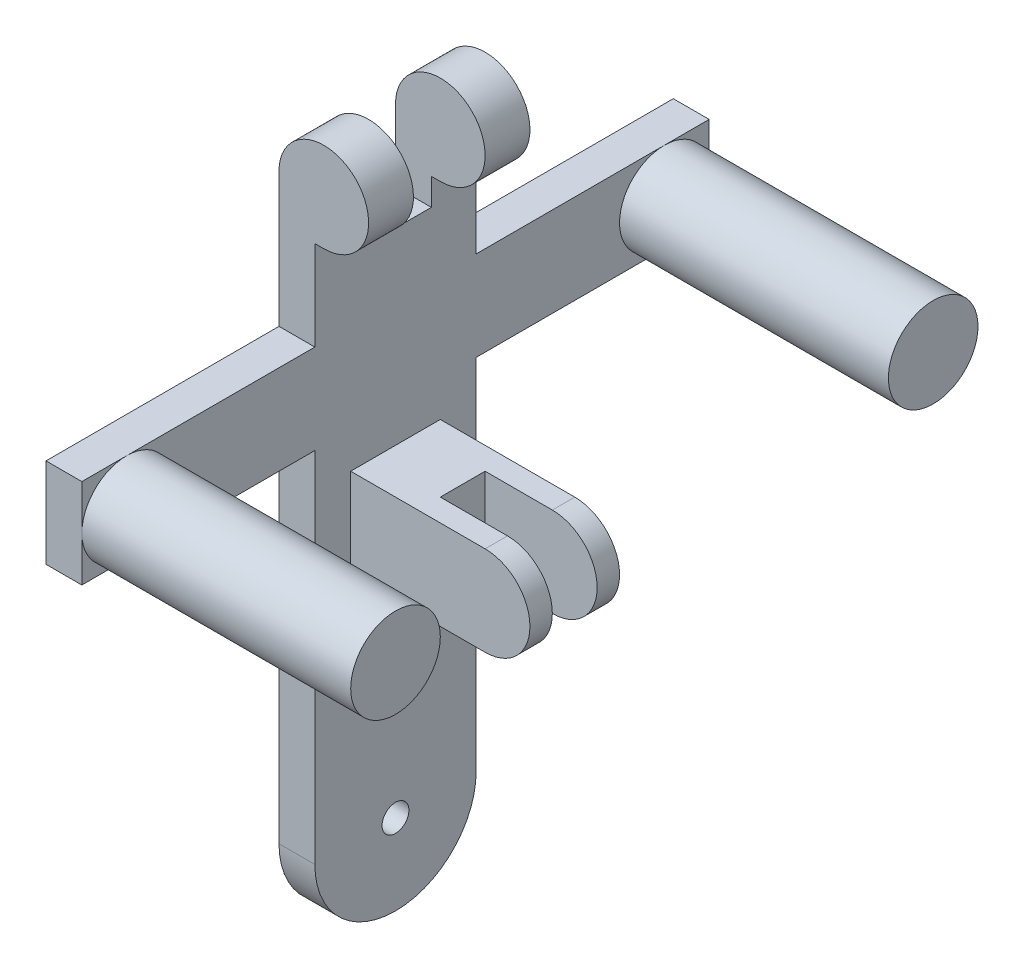
ISO-10303-21;
HEADER;
FILE_DESCRIPTION(('STEP AP214'),'2;1');
FILE_NAME('part.step','',(''),(''),'','','');
FILE_SCHEMA(('AUTOMOTIVE_DESIGN { 1 0 10303 214 1 1 1 1 }'));
ENDSEC;
DATA;
#1=APPLICATION_CONTEXT('core data for automotive mechanical design processes');
#2=APPLICATION_PROTOCOL_DEFINITION('international standard','automotive_design',2000,#1);
#3=PRODUCT_CONTEXT('',#1,'mechanical');
#4=PRODUCT('Part','Part','',(#3));
#5=PRODUCT_RELATED_PRODUCT_CATEGORY('part','',(#4));
#6=PRODUCT_DEFINITION_FORMATION('','',#4);
#7=PRODUCT_DEFINITION_CONTEXT('part definition',#1,'design');
#8=PRODUCT_DEFINITION('design','',#6,#7);
#9=PRODUCT_DEFINITION_SHAPE('','',#8);
#10=(LENGTH_UNIT() NAMED_UNIT(*) SI_UNIT(.MILLI.,.METRE.));
#11=(NAMED_UNIT(*) PLANE_ANGLE_UNIT() SI_UNIT($,.RADIAN.));
#12=(NAMED_UNIT(*) SI_UNIT($,.STERADIAN.) SOLID_ANGLE_UNIT());
#13=UNCERTAINTY_MEASURE_WITH_UNIT(LENGTH_MEASURE(1.E-05),#10,'distance_accuracy_value','');
#14=(GEOMETRIC_REPRESENTATION_CONTEXT(3) GLOBAL_UNCERTAINTY_ASSIGNED_CONTEXT((#13)) GLOBAL_UNIT_ASSIGNED_CONTEXT((#10,
#11,#12)) REPRESENTATION_CONTEXT('',''));
#15=CARTESIAN_POINT('',(0.,0.,0.));
#16=DIRECTION('',(0.,0.,1.));
#17=DIRECTION('',(1.,0.,0.));
#18=AXIS2_PLACEMENT_3D('',#15,#16,#17);
#19=CARTESIAN_POINT('',(48.,72.,10.));
#20=DIRECTION('',(0.,-1.,0.));
#21=DIRECTION('',(1.,0.,0.));
#22=AXIS2_PLACEMENT_3D('',#19,#20,#21);
#23=PLANE('',#22);
#24=DIRECTION('',(-1.,0.,0.));
#25=VECTOR('',#24,1.);
#26=CARTESIAN_POINT('',(48.,72.,-5.));
#27=LINE('',#26,#25);
#28=CARTESIAN_POINT('',(38.,72.,-5.));
#29=VERTEX_POINT('',#28);
#30=CARTESIAN_POINT('',(23.,72.,-5.));
#31=VERTEX_POINT('',#30);
#32=EDGE_CURVE('E238',#29,#31,#27,.T.);
#33=ORIENTED_EDGE('',*,*,#32,.F.);
#34=DIRECTION('',(0.,0.,-1.));
#35=VECTOR('',#34,1.);
#36=CARTESIAN_POINT('',(38.,72.,30.));
#37=LINE('',#36,#35);
#38=CARTESIAN_POINT('',(38.,72.,-10.));
#39=VERTEX_POINT('',#38);
#40=EDGE_CURVE('E61',#29,#39,#37,.T.);
#41=ORIENTED_EDGE('',*,*,#40,.T.);
#42=DIRECTION('',(-1.,0.,0.));
#43=VECTOR('',#42,1.);
#44=CARTESIAN_POINT('',(48.,72.,-10.));
#45=LINE('',#44,#43);
#46=CARTESIAN_POINT('',(8.,72.,-9.99999999999999));
#47=VERTEX_POINT('',#46);
#48=EDGE_CURVE('E276',#39,#47,#45,.T.);
#49=ORIENTED_EDGE('',*,*,#48,.T.);
#50=DIRECTION('',(0.,0.,1.));
#51=VECTOR('',#50,1.);
#52=CARTESIAN_POINT('',(8.,72.,10.));
#53=LINE('',#52,#51);
#54=CARTESIAN_POINT('',(8.,72.,10.));
#55=VERTEX_POINT('',#54);
#56=EDGE_CURVE('E271',#47,#55,#53,.T.);
#57=ORIENTED_EDGE('',*,*,#56,.T.);
#58=DIRECTION('',(-1.,0.,0.));
#59=VECTOR('',#58,1.);
#60=CARTESIAN_POINT('',(48.,72.,10.));
#61=LINE('',#60,#59);
#62=CARTESIAN_POINT('',(38.,72.,10.));
#63=VERTEX_POINT('',#62);
#64=EDGE_CURVE('E274',#63,#55,#61,.T.);
#65=ORIENTED_EDGE('',*,*,#64,.F.);
#66=CARTESIAN_POINT('',(38.,72.,5.));
#67=VERTEX_POINT('',#66);
#68=EDGE_CURVE('E247',#63,#67,#37,.T.);
#69=ORIENTED_EDGE('',*,*,#68,.T.);
#70=DIRECTION('',(-1.,0.,0.));
#71=VECTOR('',#70,1.);
#72=CARTESIAN_POINT('',(48.,72.,5.));
#73=LINE('',#72,#71);
#74=CARTESIAN_POINT('',(23.,72.,5.));
#75=VERTEX_POINT('',#74);
#76=EDGE_CURVE('E53',#67,#75,#73,.T.);
#77=ORIENTED_EDGE('',*,*,#76,.T.);
#78=DIRECTION('',(0.,0.,-1.));
#79=VECTOR('',#78,1.);
#80=CARTESIAN_POINT('',(23.,72.,10.));
#81=LINE('',#80,#79);
#82=EDGE_CURVE('E232',#75,#31,#81,.T.);
#83=ORIENTED_EDGE('',*,*,#82,.T.);
#84=EDGE_LOOP('',(#33,#41,#49,#57,#65,#69,#77,#83));
#85=FACE_BOUND('',#84,.T.);
#86=ADVANCED_FACE('F38',(#85),#23,.F.);
#87=CARTESIAN_POINT('',(48.,52.,10.));
#88=DIRECTION('',(0.,1.,0.));
#89=DIRECTION('',(-1.,0.,0.));
#90=AXIS2_PLACEMENT_3D('',#87,#88,#89);
#91=PLANE('',#90);
#92=DIRECTION('',(1.,0.,0.));
#93=VECTOR('',#92,1.);
#94=CARTESIAN_POINT('',(48.,52.,-5.));
#95=LINE('',#94,#93);
#96=CARTESIAN_POINT('',(23.,52.,-5.));
#97=VERTEX_POINT('',#96);
#98=CARTESIAN_POINT('',(38.,52.,-5.));
#99=VERTEX_POINT('',#98);
#100=EDGE_CURVE('E248',#97,#99,#95,.T.);
#101=ORIENTED_EDGE('',*,*,#100,.F.);
#102=DIRECTION('',(0.,0.,1.));
#103=VECTOR('',#102,1.);
#104=CARTESIAN_POINT('',(23.,52.,10.));
#105=LINE('',#104,#103);
#106=CARTESIAN_POINT('',(23.,52.,5.));
#107=VERTEX_POINT('',#106);
#108=EDGE_CURVE('E11',#97,#107,#105,.T.);
#109=ORIENTED_EDGE('',*,*,#108,.T.);
#110=DIRECTION('',(1.,0.,0.));
#111=VECTOR('',#110,1.);
#112=CARTESIAN_POINT('',(48.,52.,5.));
#113=LINE('',#112,#111);
#114=CARTESIAN_POINT('',(38.,52.,5.));
#115=VERTEX_POINT('',#114);
#116=EDGE_CURVE('E242',#107,#115,#113,.T.);
#117=ORIENTED_EDGE('',*,*,#116,.T.);
#118=DIRECTION('',(0.,0.,-1.));
#119=VECTOR('',#118,1.);
#120=CARTESIAN_POINT('',(38.,52.,30.));
#121=LINE('',#120,#119);
#122=CARTESIAN_POINT('',(38.,52.,10.));
#123=VERTEX_POINT('',#122);
#124=EDGE_CURVE('E255',#123,#115,#121,.T.);
#125=ORIENTED_EDGE('',*,*,#124,.F.);
#126=DIRECTION('',(-1.,0.,0.));
#127=VECTOR('',#126,1.);
#128=CARTESIAN_POINT('',(48.,52.,10.));
#129=LINE('',#128,#127);
#130=CARTESIAN_POINT('',(8.,52.,9.99999999999999));
#131=VERTEX_POINT('',#130);
#132=EDGE_CURVE('E280',#123,#131,#129,.T.);
#133=ORIENTED_EDGE('',*,*,#132,.T.);
#134=DIRECTION('',(0.,0.,-1.));
#135=VECTOR('',#134,1.);
#136=CARTESIAN_POINT('',(8.,52.,10.));
#137=LINE('',#136,#135);
#138=CARTESIAN_POINT('',(8.,52.,-10.));
#139=VERTEX_POINT('',#138);
#140=EDGE_CURVE('E265',#131,#139,#137,.T.);
#141=ORIENTED_EDGE('',*,*,#140,.T.);
#142=DIRECTION('',(-1.,0.,0.));
#143=VECTOR('',#142,1.);
#144=CARTESIAN_POINT('',(48.,52.,-10.));
#145=LINE('',#144,#143);
#146=CARTESIAN_POINT('',(38.,52.,-10.));
#147=VERTEX_POINT('',#146);
#148=EDGE_CURVE('E278',#147,#139,#145,.T.);
#149=ORIENTED_EDGE('',*,*,#148,.F.);
#150=EDGE_CURVE('E259',#99,#147,#121,.T.);
#151=ORIENTED_EDGE('',*,*,#150,.F.);
#152=EDGE_LOOP('',(#101,#109,#117,#125,#133,#141,#149,#151));
#153=FACE_BOUND('',#152,.T.);
#154=ADVANCED_FACE('F464',(#153),#91,.F.);
#155=CARTESIAN_POINT('',(38.,62.,30.));
#156=DIRECTION('',(0.,0.,-1.));
#157=DIRECTION('',(0.,1.,0.));
#158=AXIS2_PLACEMENT_3D('',#155,#156,#157);
#159=CYLINDRICAL_SURFACE('',#158,10.);
#160=CARTESIAN_POINT('',(38.,62.,-5.));
#161=DIRECTION('',(0.,0.,1.));
#162=DIRECTION('',(1.,0.,0.));
#163=AXIS2_PLACEMENT_3D('',#160,#161,#162);
#164=CIRCLE('',#163,10.);
#165=EDGE_CURVE('E46',#99,#29,#164,.T.);
#166=ORIENTED_EDGE('',*,*,#165,.F.);
#167=ORIENTED_EDGE('',*,*,#150,.T.);
#168=CARTESIAN_POINT('',(38.,62.,-10.));
#169=DIRECTION('',(0.,0.,1.));
#170=DIRECTION('',(0.,1.,0.));
#171=AXIS2_PLACEMENT_3D('',#168,#169,#170);
#172=CIRCLE('',#171,10.);
#173=EDGE_CURVE('E237',#147,#39,#172,.T.);
#174=ORIENTED_EDGE('',*,*,#173,.T.);
#175=ORIENTED_EDGE('',*,*,#40,.F.);
#176=EDGE_LOOP('',(#166,#167,#174,#175));
#177=FACE_BOUND('',#176,.T.);
#178=ADVANCED_FACE('F445',(#177),#159,.T.);
#179=CARTESIAN_POINT('',(8.,100.,70.));
#180=DIRECTION('',(-1.,0.,0.));
#181=DIRECTION('',(0.,-1.,0.));
#182=AXIS2_PLACEMENT_3D('',#179,#180,#181);
#183=PLANE('',#182);
#184=CARTESIAN_POINT('',(8.,0.,0.));
#185=DIRECTION('',(1.,0.,0.));
#186=DIRECTION('',(0.,0.,-1.));
#187=AXIS2_PLACEMENT_3D('',#184,#185,#186);
#188=CIRCLE('',#187,3.);
#189=CARTESIAN_POINT('',(8.,0.,-3.));
#190=VERTEX_POINT('',#189);
#191=EDGE_CURVE('E331',#190,#190,#188,.T.);
#192=ORIENTED_EDGE('',*,*,#191,.F.);
#193=EDGE_LOOP('',(#192));
#194=FACE_BOUND('',#193,.T.);
#195=DIRECTION('',(0.,0.,-1.));
#196=VECTOR('',#195,1.);
#197=CARTESIAN_POINT('',(8.,120.,18.));
#198=LINE('',#197,#196);
#199=CARTESIAN_POINT('',(8.,120.,-8.));
#200=VERTEX_POINT('',#199);
#201=CARTESIAN_POINT('',(8.,120.,-18.));
#202=VERTEX_POINT('',#201);
#203=EDGE_CURVE('E324',#200,#202,#198,.T.);
#204=ORIENTED_EDGE('',*,*,#203,.F.);
#205=DIRECTION('',(0.,-1.,0.));
#206=VECTOR('',#205,1.);
#207=CARTESIAN_POINT('',(8.,100.,-8.00000000000001));
#208=LINE('',#207,#206);
#209=CARTESIAN_POINT('',(8.00000000000001,114.,-8.));
#210=VERTEX_POINT('',#209);
#211=EDGE_CURVE('E301',#200,#210,#208,.T.);
#212=ORIENTED_EDGE('',*,*,#211,.T.);
#213=DIRECTION('',(0.,0.,1.));
#214=VECTOR('',#213,1.);
#215=CARTESIAN_POINT('',(8.,114.,70.));
#216=LINE('',#215,#214);
#217=CARTESIAN_POINT('',(8.00000000000001,114.,8.));
#218=VERTEX_POINT('',#217);
#219=EDGE_CURVE('E304',#210,#218,#216,.T.);
#220=ORIENTED_EDGE('',*,*,#219,.T.);
#221=DIRECTION('',(0.,1.,0.));
#222=VECTOR('',#221,1.);
#223=CARTESIAN_POINT('',(8.,100.,8.00000000000001));
#224=LINE('',#223,#222);
#225=CARTESIAN_POINT('',(8.,120.,8.));
#226=VERTEX_POINT('',#225);
#227=EDGE_CURVE('E296',#218,#226,#224,.T.);
#228=ORIENTED_EDGE('',*,*,#227,.T.);
#229=CARTESIAN_POINT('',(8.,120.,18.));
#230=VERTEX_POINT('',#229);
#231=EDGE_CURVE('E327',#230,#226,#198,.T.);
#232=ORIENTED_EDGE('',*,*,#231,.F.);
#233=DIRECTION('',(0.,-1.,0.));
#234=VECTOR('',#233,1.);
#235=CARTESIAN_POINT('',(8.,0.,18.));
#236=LINE('',#235,#234);
#237=CARTESIAN_POINT('',(8.,100.,18.));
#238=VERTEX_POINT('',#237);
#239=EDGE_CURVE('E346',#230,#238,#236,.T.);
#240=ORIENTED_EDGE('',*,*,#239,.T.);
#241=DIRECTION('',(0.,0.,-1.));
#242=VECTOR('',#241,1.);
#243=CARTESIAN_POINT('',(8.,100.,70.));
#244=LINE('',#243,#242);
#245=CARTESIAN_POINT('',(8.,100.,60.));
#246=VERTEX_POINT('',#245);
#247=EDGE_CURVE('E417',#246,#238,#244,.T.);
#248=ORIENTED_EDGE('',*,*,#247,.F.);
#249=CARTESIAN_POINT('',(8.,90.,60.));
#250=DIRECTION('',(1.,0.,0.));
#251=DIRECTION('',(0.,0.,-1.));
#252=AXIS2_PLACEMENT_3D('',#249,#250,#251);
#253=CIRCLE('',#252,10.);
#254=CARTESIAN_POINT('',(8.,80.,60.));
#255=VERTEX_POINT('',#254);
#256=EDGE_CURVE('E370',#255,#246,#253,.T.);
#257=ORIENTED_EDGE('',*,*,#256,.F.);
#258=DIRECTION('',(0.,0.,-1.));
#259=VECTOR('',#258,1.);
#260=CARTESIAN_POINT('',(8.,80.,70.));
#261=LINE('',#260,#259);
#262=CARTESIAN_POINT('',(8.,80.,18.));
#263=VERTEX_POINT('',#262);
#264=EDGE_CURVE('E404',#255,#263,#261,.T.);
#265=ORIENTED_EDGE('',*,*,#264,.T.);
#266=CARTESIAN_POINT('',(8.,0.,18.));
#267=VERTEX_POINT('',#266);
#268=EDGE_CURVE('E345',#263,#267,#236,.T.);
#269=ORIENTED_EDGE('',*,*,#268,.T.);
#270=CARTESIAN_POINT('',(8.,0.,0.));
#271=DIRECTION('',(1.,0.,0.));
#272=DIRECTION('',(0.,0.,-1.));
#273=AXIS2_PLACEMENT_3D('',#270,#271,#272);
#274=CIRCLE('',#273,18.);
#275=CARTESIAN_POINT('',(8.,0.,-18.));
#276=VERTEX_POINT('',#275);
#277=EDGE_CURVE('E337',#267,#276,#274,.T.);
#278=ORIENTED_EDGE('',*,*,#277,.T.);
#279=DIRECTION('',(0.,1.,0.));
#280=VECTOR('',#279,1.);
#281=CARTESIAN_POINT('',(8.,0.,-18.));
#282=LINE('',#281,#280);
#283=CARTESIAN_POINT('',(8.,80.,-18.));
#284=VERTEX_POINT('',#283);
#285=EDGE_CURVE('E342',#276,#284,#282,.T.);
#286=ORIENTED_EDGE('',*,*,#285,.T.);
#287=CARTESIAN_POINT('',(8.,80.,-60.));
#288=VERTEX_POINT('',#287);
#289=EDGE_CURVE('E405',#284,#288,#261,.T.);
#290=ORIENTED_EDGE('',*,*,#289,.T.);
#291=CARTESIAN_POINT('',(8.,90.,-60.));
#292=DIRECTION('',(1.,0.,0.));
#293=DIRECTION('',(0.,0.,-1.));
#294=AXIS2_PLACEMENT_3D('',#291,#292,#293);
#295=CIRCLE('',#294,9.99999999999999);
#296=CARTESIAN_POINT('',(8.,100.,-60.));
#297=VERTEX_POINT('',#296);
#298=EDGE_CURVE('E426',#297,#288,#295,.T.);
#299=ORIENTED_EDGE('',*,*,#298,.F.);
#300=CARTESIAN_POINT('',(8.,100.,-18.));
#301=VERTEX_POINT('',#300);
#302=EDGE_CURVE('E418',#301,#297,#244,.T.);
#303=ORIENTED_EDGE('',*,*,#302,.F.);
#304=EDGE_CURVE('E340',#301,#202,#282,.T.);
#305=ORIENTED_EDGE('',*,*,#304,.T.);
#306=EDGE_LOOP('',(#204,#212,#220,#228,#232,#240,#248,#257,#265,#269,#278,#286,#290,#299,#303,#305));
#307=FACE_BOUND('',#306,.T.);
#308=DIRECTION('',(0.,-1.,0.));
#309=VECTOR('',#308,1.);
#310=CARTESIAN_POINT('',(8.,72.,10.));
#311=LINE('',#310,#309);
#312=EDGE_CURVE('E262',#55,#131,#311,.T.);
#313=ORIENTED_EDGE('',*,*,#312,.F.);
#314=ORIENTED_EDGE('',*,*,#56,.F.);
#315=DIRECTION('',(0.,1.,0.));
#316=VECTOR('',#315,1.);
#317=CARTESIAN_POINT('',(8.,72.,-10.));
#318=LINE('',#317,#316);
#319=EDGE_CURVE('E268',#139,#47,#318,.T.);
#320=ORIENTED_EDGE('',*,*,#319,.F.);
#321=ORIENTED_EDGE('',*,*,#140,.F.);
#322=EDGE_LOOP('',(#313,#314,#320,#321));
#323=FACE_BOUND('',#322,.T.);
#324=ADVANCED_FACE('F455',(#194,#307,#323),#183,.F.);
#325=CARTESIAN_POINT('',(8.,120.,18.));
#326=DIRECTION('',(0.,-1.,0.));
#327=DIRECTION('',(0.,0.,-1.));
#328=AXIS2_PLACEMENT_3D('',#325,#326,#327);
#329=PLANE('',#328);
#330=DIRECTION('',(1.,0.,0.));
#331=VECTOR('',#330,1.);
#332=CARTESIAN_POINT('',(8.,120.,-8.));
#333=LINE('',#332,#331);
#334=CARTESIAN_POINT('',(10.,120.,-8.));
#335=VERTEX_POINT('',#334);
#336=EDGE_CURVE('E299',#200,#335,#333,.T.);
#337=ORIENTED_EDGE('',*,*,#336,.F.);
#338=ORIENTED_EDGE('',*,*,#203,.T.);
#339=DIRECTION('',(-1.,0.,0.));
#340=VECTOR('',#339,1.);
#341=CARTESIAN_POINT('',(8.,120.,-18.));
#342=LINE('',#341,#340);
#343=CARTESIAN_POINT('',(10.,120.,-18.));
#344=VERTEX_POINT('',#343);
#345=EDGE_CURVE('E321',#344,#202,#342,.T.);
#346=ORIENTED_EDGE('',*,*,#345,.F.);
#347=DIRECTION('',(0.,0.,1.));
#348=VECTOR('',#347,1.);
#349=CARTESIAN_POINT('',(10.,120.,-70.));
#350=LINE('',#349,#348);
#351=EDGE_CURVE('E316',#344,#335,#350,.T.);
#352=ORIENTED_EDGE('',*,*,#351,.T.);
#353=EDGE_LOOP('',(#337,#338,#346,#352));
#354=FACE_BOUND('',#353,.T.);
#355=ADVANCED_FACE('F500',(#354),#329,.T.);
#356=CARTESIAN_POINT('',(10.,130.,-70.));
#357=DIRECTION('',(0.,0.,1.));
#358=DIRECTION('',(1.,0.,0.));
#359=AXIS2_PLACEMENT_3D('',#356,#357,#358);
#360=CYLINDRICAL_SURFACE('',#359,10.);
#361=DIRECTION('',(0.,0.,1.));
#362=VECTOR('',#361,1.);
#363=CARTESIAN_POINT('',(0.,130.,-70.));
#364=LINE('',#363,#362);
#365=CARTESIAN_POINT('',(0.,130.,-18.));
#366=VERTEX_POINT('',#365);
#367=CARTESIAN_POINT('',(0.,130.,-8.));
#368=VERTEX_POINT('',#367);
#369=EDGE_CURVE('E311',#366,#368,#364,.T.);
#370=ORIENTED_EDGE('',*,*,#369,.T.);
#371=CARTESIAN_POINT('',(10.,130.,-8.));
#372=DIRECTION('',(0.,0.,-1.));
#373=DIRECTION('',(0.,1.,0.));
#374=AXIS2_PLACEMENT_3D('',#371,#372,#373);
#375=CIRCLE('',#374,10.);
#376=EDGE_CURVE('E435',#368,#335,#375,.T.);
#377=ORIENTED_EDGE('',*,*,#376,.T.);
#378=ORIENTED_EDGE('',*,*,#351,.F.);
#379=CARTESIAN_POINT('',(10.,130.,-18.));
#380=DIRECTION('',(0.,0.,1.));
#381=DIRECTION('',(1.,0.,0.));
#382=AXIS2_PLACEMENT_3D('',#379,#380,#381);
#383=CIRCLE('',#382,10.);
#384=EDGE_CURVE('E314',#366,#344,#383,.F.);
#385=ORIENTED_EDGE('',*,*,#384,.F.);
#386=EDGE_LOOP('',(#370,#377,#378,#385));
#387=FACE_BOUND('',#386,.T.);
#388=ADVANCED_FACE('F495',(#387),#360,.T.);
#389=CARTESIAN_POINT('',(8.,100.,70.));
#390=DIRECTION('',(0.,-1.,0.));
#391=DIRECTION('',(0.,0.,-1.));
#392=AXIS2_PLACEMENT_3D('',#389,#390,#391);
#393=PLANE('',#392);
#394=DIRECTION('',(-1.,0.,0.));
#395=VECTOR('',#394,1.);
#396=CARTESIAN_POINT('',(8.,100.,-18.));
#397=LINE('',#396,#395);
#398=CARTESIAN_POINT('',(0.,100.,-18.));
#399=VERTEX_POINT('',#398);
#400=EDGE_CURVE('E367',#301,#399,#397,.T.);
#401=ORIENTED_EDGE('',*,*,#400,.F.);
#402=ORIENTED_EDGE('',*,*,#302,.T.);
#403=CARTESIAN_POINT('',(8.,100.,-70.));
#404=VERTEX_POINT('',#403);
#405=EDGE_CURVE('E412',#297,#404,#244,.T.);
#406=ORIENTED_EDGE('',*,*,#405,.T.);
#407=DIRECTION('',(-1.,0.,0.));
#408=VECTOR('',#407,1.);
#409=CARTESIAN_POINT('',(8.,100.,-70.));
#410=LINE('',#409,#408);
#411=CARTESIAN_POINT('',(0.,100.,-70.));
#412=VERTEX_POINT('',#411);
#413=EDGE_CURVE('E392',#404,#412,#410,.T.);
#414=ORIENTED_EDGE('',*,*,#413,.T.);
#415=DIRECTION('',(0.,0.,-1.));
#416=VECTOR('',#415,1.);
#417=CARTESIAN_POINT('',(0.,100.,70.));
#418=LINE('',#417,#416);
#419=EDGE_CURVE('E408',#399,#412,#418,.T.);
#420=ORIENTED_EDGE('',*,*,#419,.F.);
#421=EDGE_LOOP('',(#401,#402,#406,#414,#420));
#422=FACE_BOUND('',#421,.T.);
#423=ADVANCED_FACE('F545',(#422),#393,.F.);
#424=DIRECTION('',(1.,0.,0.));
#425=VECTOR('',#424,1.);
#426=CARTESIAN_POINT('',(8.,100.,18.));
#427=LINE('',#426,#425);
#428=CARTESIAN_POINT('',(0.,100.,18.));
#429=VERTEX_POINT('',#428);
#430=EDGE_CURVE('E364',#429,#238,#427,.T.);
#431=ORIENTED_EDGE('',*,*,#430,.F.);
#432=CARTESIAN_POINT('',(0.,100.,70.));
#433=VERTEX_POINT('',#432);
#434=EDGE_CURVE('E409',#433,#429,#418,.T.);
#435=ORIENTED_EDGE('',*,*,#434,.F.);
#436=DIRECTION('',(-1.,0.,0.));
#437=VECTOR('',#436,1.);
#438=CARTESIAN_POINT('',(8.,100.,70.));
#439=LINE('',#438,#437);
#440=CARTESIAN_POINT('',(8.,100.,70.));
#441=VERTEX_POINT('',#440);
#442=EDGE_CURVE('E382',#441,#433,#439,.T.);
#443=ORIENTED_EDGE('',*,*,#442,.F.);
#444=EDGE_CURVE('E413',#441,#246,#244,.T.);
#445=ORIENTED_EDGE('',*,*,#444,.T.);
#446=ORIENTED_EDGE('',*,*,#247,.T.);
#447=EDGE_LOOP('',(#431,#435,#443,#445,#446));
#448=FACE_BOUND('',#447,.T.);
#449=ADVANCED_FACE('F539',(#448),#393,.F.);
#450=CARTESIAN_POINT('',(8.,80.,70.));
#451=DIRECTION('',(0.,1.,0.));
#452=DIRECTION('',(0.,0.,1.));
#453=AXIS2_PLACEMENT_3D('',#450,#451,#452);
#454=PLANE('',#453);
#455=DIRECTION('',(1.,0.,0.));
#456=VECTOR('',#455,1.);
#457=CARTESIAN_POINT('',(8.,80.,-18.));
#458=LINE('',#457,#456);
#459=CARTESIAN_POINT('',(0.,80.,-18.));
#460=VERTEX_POINT('',#459);
#461=EDGE_CURVE('E429',#460,#284,#458,.T.);
#462=ORIENTED_EDGE('',*,*,#461,.F.);
#463=DIRECTION('',(0.,0.,-1.));
#464=VECTOR('',#463,1.);
#465=CARTESIAN_POINT('',(0.,80.,70.));
#466=LINE('',#465,#464);
#467=CARTESIAN_POINT('',(0.,80.,-70.));
#468=VERTEX_POINT('',#467);
#469=EDGE_CURVE('E403',#460,#468,#466,.T.);
#470=ORIENTED_EDGE('',*,*,#469,.T.);
#471=DIRECTION('',(1.,0.,0.));
#472=VECTOR('',#471,1.);
#473=CARTESIAN_POINT('',(8.,80.,-70.));
#474=LINE('',#473,#472);
#475=CARTESIAN_POINT('',(8.,80.,-70.));
#476=VERTEX_POINT('',#475);
#477=EDGE_CURVE('E398',#468,#476,#474,.T.);
#478=ORIENTED_EDGE('',*,*,#477,.T.);
#479=EDGE_CURVE('E389',#288,#476,#261,.T.);
#480=ORIENTED_EDGE('',*,*,#479,.F.);
#481=ORIENTED_EDGE('',*,*,#289,.F.);
#482=EDGE_LOOP('',(#462,#470,#478,#480,#481));
#483=FACE_BOUND('',#482,.T.);
#484=ADVANCED_FACE('F535',(#483),#454,.F.);
#485=DIRECTION('',(-1.,0.,0.));
#486=VECTOR('',#485,1.);
#487=CARTESIAN_POINT('',(8.,80.,18.));
#488=LINE('',#487,#486);
#489=CARTESIAN_POINT('',(0.,80.,18.));
#490=VERTEX_POINT('',#489);
#491=EDGE_CURVE('E422',#263,#490,#488,.T.);
#492=ORIENTED_EDGE('',*,*,#491,.F.);
#493=ORIENTED_EDGE('',*,*,#264,.F.);
#494=CARTESIAN_POINT('',(8.,80.,70.));
#495=VERTEX_POINT('',#494);
#496=EDGE_CURVE('E401',#495,#255,#261,.T.);
#497=ORIENTED_EDGE('',*,*,#496,.F.);
#498=DIRECTION('',(1.,0.,0.));
#499=VECTOR('',#498,1.);
#500=CARTESIAN_POINT('',(8.,80.,70.));
#501=LINE('',#500,#499);
#502=CARTESIAN_POINT('',(0.,80.,70.));
#503=VERTEX_POINT('',#502);
#504=EDGE_CURVE('E387',#503,#495,#501,.T.);
#505=ORIENTED_EDGE('',*,*,#504,.F.);
#506=EDGE_CURVE('E406',#503,#490,#466,.T.);
#507=ORIENTED_EDGE('',*,*,#506,.T.);
#508=EDGE_LOOP('',(#492,#493,#497,#505,#507));
#509=FACE_BOUND('',#508,.T.);
#510=ADVANCED_FACE('F538',(#509),#454,.F.);
#511=CARTESIAN_POINT('',(8.,90.,70.));
#512=VERTEX_POINT('',#511);
#513=EDGE_CURVE('E375',#246,#512,#253,.T.);
#514=ORIENTED_EDGE('',*,*,#513,.F.);
#515=ORIENTED_EDGE('',*,*,#444,.F.);
#516=DIRECTION('',(0.,1.,0.));
#517=VECTOR('',#516,1.);
#518=CARTESIAN_POINT('',(8.,100.,70.));
#519=LINE('',#518,#517);
#520=EDGE_CURVE('E383',#512,#441,#519,.T.);
#521=ORIENTED_EDGE('',*,*,#520,.F.);
#522=EDGE_LOOP('',(#514,#515,#521));
#523=FACE_BOUND('',#522,.T.);
#524=ADVANCED_FACE('F561',(#523),#183,.F.);
#525=CARTESIAN_POINT('',(68.,90.,-60.));
#526=DIRECTION('',(-1.,0.,0.));
#527=DIRECTION('',(0.,0.,1.));
#528=AXIS2_PLACEMENT_3D('',#525,#526,#527);
#529=CYLINDRICAL_SURFACE('',#528,9.99999999999999);
#530=CARTESIAN_POINT('',(68.,90.,-60.));
#531=DIRECTION('',(1.,0.,0.));
#532=DIRECTION('',(0.,0.,-1.));
#533=AXIS2_PLACEMENT_3D('',#530,#531,#532);
#534=CIRCLE('',#533,9.99999999999999);
#535=CARTESIAN_POINT('',(68.,90.,-70.));
#536=VERTEX_POINT('',#535);
#537=EDGE_CURVE('E419',#536,#536,#534,.T.);
#538=ORIENTED_EDGE('',*,*,#537,.F.);
#539=EDGE_LOOP('',(#538));
#540=FACE_BOUND('',#539,.T.);
#541=CARTESIAN_POINT('',(8.,90.,-70.));
#542=VERTEX_POINT('',#541);
#543=EDGE_CURVE('E423',#542,#297,#295,.T.);
#544=ORIENTED_EDGE('',*,*,#543,.T.);
#545=ORIENTED_EDGE('',*,*,#298,.T.);
#546=EDGE_CURVE('E416',#288,#542,#295,.T.);
#547=ORIENTED_EDGE('',*,*,#546,.T.);
#548=EDGE_LOOP('',(#544,#545,#547));
#549=FACE_BOUND('',#548,.T.);
#550=ADVANCED_FACE('F40',(#540,#549),#529,.T.);
#551=CARTESIAN_POINT('',(68.,90.,-60.));
#552=DIRECTION('',(1.,0.,0.));
#553=DIRECTION('',(0.,0.,-1.));
#554=AXIS2_PLACEMENT_3D('',#551,#552,#553);
#555=PLANE('',#554);
#556=ORIENTED_EDGE('',*,*,#537,.T.);
#557=EDGE_LOOP('',(#556));
#558=FACE_BOUND('',#557,.T.);
#559=ADVANCED_FACE('F552',(#558),#555,.T.);
#560=ORIENTED_EDGE('',*,*,#543,.F.);
#561=DIRECTION('',(0.,1.,0.));
#562=VECTOR('',#561,1.);
#563=CARTESIAN_POINT('',(8.,100.,-70.));
#564=LINE('',#563,#562);
#565=EDGE_CURVE('E374',#542,#404,#564,.T.);
#566=ORIENTED_EDGE('',*,*,#565,.T.);
#567=ORIENTED_EDGE('',*,*,#405,.F.);
#568=EDGE_LOOP('',(#560,#566,#567));
#569=FACE_BOUND('',#568,.T.);
#570=ADVANCED_FACE('F554',(#569),#183,.F.);
#571=EDGE_CURVE('E378',#512,#255,#253,.T.);
#572=ORIENTED_EDGE('',*,*,#571,.F.);
#573=EDGE_CURVE('E379',#495,#512,#519,.T.);
#574=ORIENTED_EDGE('',*,*,#573,.F.);
#575=ORIENTED_EDGE('',*,*,#496,.T.);
#576=EDGE_LOOP('',(#572,#574,#575));
#577=FACE_BOUND('',#576,.T.);
#578=ADVANCED_FACE('F550',(#577),#183,.F.);
#579=ORIENTED_EDGE('',*,*,#546,.F.);
#580=ORIENTED_EDGE('',*,*,#479,.T.);
#581=EDGE_CURVE('E390',#476,#542,#564,.T.);
#582=ORIENTED_EDGE('',*,*,#581,.T.);
#583=EDGE_LOOP('',(#579,#580,#582));
#584=FACE_BOUND('',#583,.T.);
#585=ADVANCED_FACE('F543',(#584),#183,.F.);
#586=CARTESIAN_POINT('',(0.,100.,70.));
#587=DIRECTION('',(1.,0.,0.));
#588=DIRECTION('',(0.,1.,0.));
#589=AXIS2_PLACEMENT_3D('',#586,#587,#588);
#590=PLANE('',#589);
#591=DIRECTION('',(0.,0.,1.));
#592=VECTOR('',#591,1.);
#593=CARTESIAN_POINT('',(0.,114.,-8.));
#594=LINE('',#593,#592);
#595=CARTESIAN_POINT('',(0.,114.,-8.));
#596=VERTEX_POINT('',#595);
#597=CARTESIAN_POINT('',(0.,114.,8.));
#598=VERTEX_POINT('',#597);
#599=EDGE_CURVE('E285',#596,#598,#594,.T.);
#600=ORIENTED_EDGE('',*,*,#599,.F.);
#601=DIRECTION('',(0.,-1.,0.));
#602=VECTOR('',#601,1.);
#603=CARTESIAN_POINT('',(0.,149.268464787872,-8.));
#604=LINE('',#603,#602);
#605=EDGE_CURVE('E282',#368,#596,#604,.T.);
#606=ORIENTED_EDGE('',*,*,#605,.F.);
#607=ORIENTED_EDGE('',*,*,#369,.F.);
#608=DIRECTION('',(0.,1.,0.));
#609=VECTOR('',#608,1.);
#610=CARTESIAN_POINT('',(0.,0.,-18.));
#611=LINE('',#610,#609);
#612=EDGE_CURVE('E352',#399,#366,#611,.T.);
#613=ORIENTED_EDGE('',*,*,#612,.F.);
#614=ORIENTED_EDGE('',*,*,#419,.T.);
#615=DIRECTION('',(0.,-1.,0.));
#616=VECTOR('',#615,1.);
#617=CARTESIAN_POINT('',(0.,100.,-70.));
#618=LINE('',#617,#616);
#619=EDGE_CURVE('E395',#412,#468,#618,.T.);
#620=ORIENTED_EDGE('',*,*,#619,.T.);
#621=ORIENTED_EDGE('',*,*,#469,.F.);
#622=CARTESIAN_POINT('',(0.,0.,-18.));
#623=VERTEX_POINT('',#622);
#624=EDGE_CURVE('E353',#623,#460,#611,.T.);
#625=ORIENTED_EDGE('',*,*,#624,.F.);
#626=CARTESIAN_POINT('',(0.,0.,0.));
#627=DIRECTION('',(1.,0.,0.));
#628=DIRECTION('',(0.,0.,-1.));
#629=AXIS2_PLACEMENT_3D('',#626,#627,#628);
#630=CIRCLE('',#629,18.);
#631=CARTESIAN_POINT('',(0.,0.,18.));
#632=VERTEX_POINT('',#631);
#633=EDGE_CURVE('E334',#632,#623,#630,.T.);
#634=ORIENTED_EDGE('',*,*,#633,.F.);
#635=DIRECTION('',(0.,-1.,0.));
#636=VECTOR('',#635,1.);
#637=CARTESIAN_POINT('',(0.,0.,18.));
#638=LINE('',#637,#636);
#639=EDGE_CURVE('E356',#490,#632,#638,.T.);
#640=ORIENTED_EDGE('',*,*,#639,.F.);
#641=ORIENTED_EDGE('',*,*,#506,.F.);
#642=DIRECTION('',(0.,-1.,0.));
#643=VECTOR('',#642,1.);
#644=CARTESIAN_POINT('',(0.,100.,70.));
#645=LINE('',#644,#643);
#646=EDGE_CURVE('E385',#433,#503,#645,.T.);
#647=ORIENTED_EDGE('',*,*,#646,.F.);
#648=ORIENTED_EDGE('',*,*,#434,.T.);
#649=CARTESIAN_POINT('',(0.,130.,18.));
#650=VERTEX_POINT('',#649);
#651=EDGE_CURVE('E341',#650,#429,#638,.T.);
#652=ORIENTED_EDGE('',*,*,#651,.F.);
#653=CARTESIAN_POINT('',(0.,130.,7.99999999999999));
#654=VERTEX_POINT('',#653);
#655=EDGE_CURVE('E315',#654,#650,#364,.T.);
#656=ORIENTED_EDGE('',*,*,#655,.F.);
#657=DIRECTION('',(0.,1.,0.));
#658=VECTOR('',#657,1.);
#659=CARTESIAN_POINT('',(0.,149.268464787872,8.));
#660=LINE('',#659,#658);
#661=EDGE_CURVE('E288',#598,#654,#660,.T.);
#662=ORIENTED_EDGE('',*,*,#661,.F.);
#663=EDGE_LOOP('',(#600,#606,#607,#613,#614,#620,#621,#625,#634,#640,#641,#647,#648,#652,#656,#662));
#664=FACE_BOUND('',#663,.T.);
#665=CARTESIAN_POINT('',(0.,0.,0.));
#666=DIRECTION('',(1.,0.,0.));
#667=DIRECTION('',(0.,0.,-1.));
#668=AXIS2_PLACEMENT_3D('',#665,#666,#667);
#669=CIRCLE('',#668,3.);
#670=CARTESIAN_POINT('',(0.,0.,-3.));
#671=VERTEX_POINT('',#670);
#672=EDGE_CURVE('E330',#671,#671,#669,.T.);
#673=ORIENTED_EDGE('',*,*,#672,.T.);
#674=EDGE_LOOP('',(#673));
#675=FACE_BOUND('',#674,.T.);
#676=ADVANCED_FACE('F530',(#664,#675),#590,.F.);
#677=CARTESIAN_POINT('',(0.,0.,70.));
#678=DIRECTION('',(0.,0.,-1.));
#679=DIRECTION('',(-1.,0.,0.));
#680=AXIS2_PLACEMENT_3D('',#677,#678,#679);
#681=PLANE('',#680);
#682=ORIENTED_EDGE('',*,*,#573,.T.);
#683=ORIENTED_EDGE('',*,*,#520,.T.);
#684=ORIENTED_EDGE('',*,*,#442,.T.);
#685=ORIENTED_EDGE('',*,*,#646,.T.);
#686=ORIENTED_EDGE('',*,*,#504,.T.);
#687=EDGE_LOOP('',(#682,#683,#684,#685,#686));
#688=FACE_BOUND('',#687,.T.);
#689=ADVANCED_FACE('F527',(#688),#681,.F.);
#690=CARTESIAN_POINT('',(0.,0.,-70.));
#691=DIRECTION('',(0.,0.,-1.));
#692=DIRECTION('',(-1.,0.,0.));
#693=AXIS2_PLACEMENT_3D('',#690,#691,#692);
#694=PLANE('',#693);
#695=ORIENTED_EDGE('',*,*,#581,.F.);
#696=ORIENTED_EDGE('',*,*,#477,.F.);
#697=ORIENTED_EDGE('',*,*,#619,.F.);
#698=ORIENTED_EDGE('',*,*,#413,.F.);
#699=ORIENTED_EDGE('',*,*,#565,.F.);
#700=EDGE_LOOP('',(#695,#696,#697,#698,#699));
#701=FACE_BOUND('',#700,.T.);
#702=ADVANCED_FACE('F525',(#701),#694,.T.);
#703=CARTESIAN_POINT('',(68.,90.,60.));
#704=DIRECTION('',(-1.,0.,0.));
#705=DIRECTION('',(0.,0.,1.));
#706=AXIS2_PLACEMENT_3D('',#703,#704,#705);
#707=CYLINDRICAL_SURFACE('',#706,10.);
#708=CARTESIAN_POINT('',(68.,90.,60.));
#709=DIRECTION('',(1.,0.,0.));
#710=DIRECTION('',(0.,0.,-1.));
#711=AXIS2_PLACEMENT_3D('',#708,#709,#710);
#712=CIRCLE('',#711,10.);
#713=CARTESIAN_POINT('',(68.,90.,50.));
#714=VERTEX_POINT('',#713);
#715=EDGE_CURVE('E371',#714,#714,#712,.T.);
#716=ORIENTED_EDGE('',*,*,#715,.F.);
#717=EDGE_LOOP('',(#716));
#718=FACE_BOUND('',#717,.T.);
#719=ORIENTED_EDGE('',*,*,#513,.T.);
#720=ORIENTED_EDGE('',*,*,#571,.T.);
#721=ORIENTED_EDGE('',*,*,#256,.T.);
#722=EDGE_LOOP('',(#719,#720,#721));
#723=FACE_BOUND('',#722,.T.);
#724=ADVANCED_FACE('F521',(#718,#723),#707,.T.);
#725=CARTESIAN_POINT('',(68.,90.,60.));
#726=DIRECTION('',(1.,0.,0.));
#727=DIRECTION('',(0.,0.,-1.));
#728=AXIS2_PLACEMENT_3D('',#725,#726,#727);
#729=PLANE('',#728);
#730=ORIENTED_EDGE('',*,*,#715,.T.);
#731=EDGE_LOOP('',(#730));
#732=FACE_BOUND('',#731,.T.);
#733=ADVANCED_FACE('F505',(#732),#729,.T.);
#734=CARTESIAN_POINT('',(8.,0.,0.));
#735=DIRECTION('',(-1.,0.,0.));
#736=DIRECTION('',(0.,0.,1.));
#737=AXIS2_PLACEMENT_3D('',#734,#735,#736);
#738=CYLINDRICAL_SURFACE('',#737,3.);
#739=ORIENTED_EDGE('',*,*,#191,.T.);
#740=EDGE_LOOP('',(#739));
#741=FACE_BOUND('',#740,.T.);
#742=ORIENTED_EDGE('',*,*,#672,.F.);
#743=EDGE_LOOP('',(#742));
#744=FACE_BOUND('',#743,.T.);
#745=ADVANCED_FACE('F501',(#741,#744),#738,.F.);
#746=CARTESIAN_POINT('',(8.,0.,0.));
#747=DIRECTION('',(-1.,0.,0.));
#748=DIRECTION('',(0.,0.,1.));
#749=AXIS2_PLACEMENT_3D('',#746,#747,#748);
#750=CYLINDRICAL_SURFACE('',#749,18.);
#751=ORIENTED_EDGE('',*,*,#633,.T.);
#752=DIRECTION('',(-1.,0.,0.));
#753=VECTOR('',#752,1.);
#754=CARTESIAN_POINT('',(8.,0.,-18.));
#755=LINE('',#754,#753);
#756=EDGE_CURVE('E361',#276,#623,#755,.T.);
#757=ORIENTED_EDGE('',*,*,#756,.F.);
#758=ORIENTED_EDGE('',*,*,#277,.F.);
#759=DIRECTION('',(-1.,0.,0.));
#760=VECTOR('',#759,1.);
#761=CARTESIAN_POINT('',(8.,0.,18.));
#762=LINE('',#761,#760);
#763=EDGE_CURVE('E349',#267,#632,#762,.T.);
#764=ORIENTED_EDGE('',*,*,#763,.T.);
#765=EDGE_LOOP('',(#751,#757,#758,#764));
#766=FACE_BOUND('',#765,.T.);
#767=ADVANCED_FACE('F504',(#766),#750,.T.);
#768=CARTESIAN_POINT('',(8.,0.,-18.));
#769=DIRECTION('',(0.,0.,1.));
#770=DIRECTION('',(1.,0.,0.));
#771=AXIS2_PLACEMENT_3D('',#768,#769,#770);
#772=PLANE('',#771);
#773=ORIENTED_EDGE('',*,*,#624,.T.);
#774=ORIENTED_EDGE('',*,*,#461,.T.);
#775=ORIENTED_EDGE('',*,*,#285,.F.);
#776=ORIENTED_EDGE('',*,*,#756,.T.);
#777=EDGE_LOOP('',(#773,#774,#775,#776));
#778=FACE_BOUND('',#777,.T.);
#779=ADVANCED_FACE('F515',(#778),#772,.F.);
#780=CARTESIAN_POINT('',(8.,0.,18.));
#781=DIRECTION('',(0.,0.,-1.));
#782=DIRECTION('',(-1.,0.,0.));
#783=AXIS2_PLACEMENT_3D('',#780,#781,#782);
#784=PLANE('',#783);
#785=ORIENTED_EDGE('',*,*,#268,.F.);
#786=ORIENTED_EDGE('',*,*,#491,.T.);
#787=ORIENTED_EDGE('',*,*,#639,.T.);
#788=ORIENTED_EDGE('',*,*,#763,.F.);
#789=EDGE_LOOP('',(#785,#786,#787,#788));
#790=FACE_BOUND('',#789,.T.);
#791=ADVANCED_FACE('F511',(#790),#784,.F.);
#792=ORIENTED_EDGE('',*,*,#304,.F.);
#793=ORIENTED_EDGE('',*,*,#400,.T.);
#794=ORIENTED_EDGE('',*,*,#612,.T.);
#795=ORIENTED_EDGE('',*,*,#384,.T.);
#796=ORIENTED_EDGE('',*,*,#345,.T.);
#797=EDGE_LOOP('',(#792,#793,#794,#795,#796));
#798=FACE_BOUND('',#797,.T.);
#799=ADVANCED_FACE('F509',(#798),#772,.F.);
#800=ORIENTED_EDGE('',*,*,#651,.T.);
#801=ORIENTED_EDGE('',*,*,#430,.T.);
#802=ORIENTED_EDGE('',*,*,#239,.F.);
#803=DIRECTION('',(-1.,0.,0.));
#804=VECTOR('',#803,1.);
#805=CARTESIAN_POINT('',(8.,120.,18.));
#806=LINE('',#805,#804);
#807=CARTESIAN_POINT('',(10.,120.,18.));
#808=VERTEX_POINT('',#807);
#809=EDGE_CURVE('E322',#808,#230,#806,.T.);
#810=ORIENTED_EDGE('',*,*,#809,.F.);
#811=CARTESIAN_POINT('',(10.,130.,18.));
#812=DIRECTION('',(0.,0.,-1.));
#813=DIRECTION('',(1.,0.,0.));
#814=AXIS2_PLACEMENT_3D('',#811,#812,#813);
#815=CIRCLE('',#814,10.);
#816=EDGE_CURVE('E307',#650,#808,#815,.T.);
#817=ORIENTED_EDGE('',*,*,#816,.F.);
#818=EDGE_LOOP('',(#800,#801,#802,#810,#817));
#819=FACE_BOUND('',#818,.T.);
#820=ADVANCED_FACE('F498',(#819),#784,.F.);
#821=DIRECTION('',(-1.,0.,0.));
#822=VECTOR('',#821,1.);
#823=CARTESIAN_POINT('',(8.,120.,8.));
#824=LINE('',#823,#822);
#825=CARTESIAN_POINT('',(10.,120.,7.99999999999999));
#826=VERTEX_POINT('',#825);
#827=EDGE_CURVE('E293',#826,#226,#824,.T.);
#828=ORIENTED_EDGE('',*,*,#827,.F.);
#829=EDGE_CURVE('E310',#826,#808,#350,.T.);
#830=ORIENTED_EDGE('',*,*,#829,.T.);
#831=ORIENTED_EDGE('',*,*,#809,.T.);
#832=ORIENTED_EDGE('',*,*,#231,.T.);
#833=EDGE_LOOP('',(#828,#830,#831,#832));
#834=FACE_BOUND('',#833,.T.);
#835=ADVANCED_FACE('F493',(#834),#329,.T.);
#836=ORIENTED_EDGE('',*,*,#829,.F.);
#837=CARTESIAN_POINT('',(10.,130.,7.99999999999999));
#838=DIRECTION('',(0.,0.,1.));
#839=DIRECTION('',(0.,-1.,0.));
#840=AXIS2_PLACEMENT_3D('',#837,#838,#839);
#841=CIRCLE('',#840,10.);
#842=EDGE_CURVE('E432',#826,#654,#841,.T.);
#843=ORIENTED_EDGE('',*,*,#842,.T.);
#844=ORIENTED_EDGE('',*,*,#655,.T.);
#845=ORIENTED_EDGE('',*,*,#816,.T.);
#846=EDGE_LOOP('',(#836,#843,#844,#845));
#847=FACE_BOUND('',#846,.T.);
#848=ADVANCED_FACE('F486',(#847),#360,.T.);
#849=CARTESIAN_POINT('',(140.,114.,-8.));
#850=DIRECTION('',(0.,-1.,0.));
#851=DIRECTION('',(1.,0.,0.));
#852=AXIS2_PLACEMENT_3D('',#849,#850,#851);
#853=PLANE('',#852);
#854=DIRECTION('',(-1.,0.,0.));
#855=VECTOR('',#854,1.);
#856=CARTESIAN_POINT('',(140.,114.,-8.));
#857=LINE('',#856,#855);
#858=EDGE_CURVE('E290',#210,#596,#857,.T.);
#859=ORIENTED_EDGE('',*,*,#858,.T.);
#860=ORIENTED_EDGE('',*,*,#599,.T.);
#861=DIRECTION('',(-1.,0.,0.));
#862=VECTOR('',#861,1.);
#863=CARTESIAN_POINT('',(140.,114.,8.));
#864=LINE('',#863,#862);
#865=EDGE_CURVE('E291',#218,#598,#864,.T.);
#866=ORIENTED_EDGE('',*,*,#865,.F.);
#867=ORIENTED_EDGE('',*,*,#219,.F.);
#868=EDGE_LOOP('',(#859,#860,#866,#867));
#869=FACE_BOUND('',#868,.T.);
#870=ADVANCED_FACE('F483',(#869),#853,.F.);
#871=CARTESIAN_POINT('',(140.,149.268464787872,-8.));
#872=DIRECTION('',(0.,0.,-1.));
#873=DIRECTION('',(0.,1.,0.));
#874=AXIS2_PLACEMENT_3D('',#871,#872,#873);
#875=PLANE('',#874);
#876=ORIENTED_EDGE('',*,*,#336,.T.);
#877=ORIENTED_EDGE('',*,*,#376,.F.);
#878=ORIENTED_EDGE('',*,*,#605,.T.);
#879=ORIENTED_EDGE('',*,*,#858,.F.);
#880=ORIENTED_EDGE('',*,*,#211,.F.);
#881=EDGE_LOOP('',(#876,#877,#878,#879,#880));
#882=FACE_BOUND('',#881,.T.);
#883=ADVANCED_FACE('F481',(#882),#875,.F.);
#884=CARTESIAN_POINT('',(140.,149.268464787872,8.));
#885=DIRECTION('',(0.,0.,1.));
#886=DIRECTION('',(0.,-1.,0.));
#887=AXIS2_PLACEMENT_3D('',#884,#885,#886);
#888=PLANE('',#887);
#889=ORIENTED_EDGE('',*,*,#865,.T.);
#890=ORIENTED_EDGE('',*,*,#661,.T.);
#891=ORIENTED_EDGE('',*,*,#842,.F.);
#892=ORIENTED_EDGE('',*,*,#827,.T.);
#893=ORIENTED_EDGE('',*,*,#227,.F.);
#894=EDGE_LOOP('',(#889,#890,#891,#892,#893));
#895=FACE_BOUND('',#894,.T.);
#896=ADVANCED_FACE('F478',(#895),#888,.F.);
#897=CARTESIAN_POINT('',(48.,72.,10.));
#898=DIRECTION('',(0.,0.,-1.));
#899=DIRECTION('',(0.,1.,0.));
#900=AXIS2_PLACEMENT_3D('',#897,#898,#899);
#901=PLANE('',#900);
#902=ORIENTED_EDGE('',*,*,#132,.F.);
#903=CARTESIAN_POINT('',(38.,62.,10.));
#904=DIRECTION('',(0.,0.,-1.));
#905=DIRECTION('',(0.,1.,0.));
#906=AXIS2_PLACEMENT_3D('',#903,#904,#905);
#907=CIRCLE('',#906,10.);
#908=EDGE_CURVE('E258',#123,#63,#907,.F.);
#909=ORIENTED_EDGE('',*,*,#908,.T.);
#910=ORIENTED_EDGE('',*,*,#64,.T.);
#911=ORIENTED_EDGE('',*,*,#312,.T.);
#912=EDGE_LOOP('',(#902,#909,#910,#911));
#913=FACE_BOUND('',#912,.T.);
#914=ADVANCED_FACE('F459',(#913),#901,.F.);
#915=CARTESIAN_POINT('',(48.,72.,-10.));
#916=DIRECTION('',(0.,0.,1.));
#917=DIRECTION('',(0.,-1.,0.));
#918=AXIS2_PLACEMENT_3D('',#915,#916,#917);
#919=PLANE('',#918);
#920=ORIENTED_EDGE('',*,*,#48,.F.);
#921=ORIENTED_EDGE('',*,*,#173,.F.);
#922=ORIENTED_EDGE('',*,*,#148,.T.);
#923=ORIENTED_EDGE('',*,*,#319,.T.);
#924=EDGE_LOOP('',(#920,#921,#922,#923));
#925=FACE_BOUND('',#924,.T.);
#926=ADVANCED_FACE('F450',(#925),#919,.F.);
#927=ORIENTED_EDGE('',*,*,#124,.T.);
#928=CARTESIAN_POINT('',(38.,62.,5.));
#929=DIRECTION('',(0.,0.,1.));
#930=DIRECTION('',(1.,0.,0.));
#931=AXIS2_PLACEMENT_3D('',#928,#929,#930);
#932=CIRCLE('',#931,10.);
#933=EDGE_CURVE('E438',#115,#67,#932,.T.);
#934=ORIENTED_EDGE('',*,*,#933,.T.);
#935=ORIENTED_EDGE('',*,*,#68,.F.);
#936=ORIENTED_EDGE('',*,*,#908,.F.);
#937=EDGE_LOOP('',(#927,#934,#935,#936));
#938=FACE_BOUND('',#937,.T.);
#939=ADVANCED_FACE('F462',(#938),#159,.T.);
#940=CARTESIAN_POINT('',(23.,74.824030413802,-5.));
#941=DIRECTION('',(-1.,0.,0.));
#942=DIRECTION('',(0.,-1.,0.));
#943=AXIS2_PLACEMENT_3D('',#940,#941,#942);
#944=PLANE('',#943);
#945=DIRECTION('',(0.,-1.,0.));
#946=VECTOR('',#945,1.);
#947=CARTESIAN_POINT('',(23.,74.824030413802,5.));
#948=LINE('',#947,#946);
#949=EDGE_CURVE('E234',#75,#107,#948,.T.);
#950=ORIENTED_EDGE('',*,*,#949,.T.);
#951=ORIENTED_EDGE('',*,*,#108,.F.);
#952=DIRECTION('',(0.,-1.,0.));
#953=VECTOR('',#952,1.);
#954=CARTESIAN_POINT('',(23.,74.824030413802,-5.));
#955=LINE('',#954,#953);
#956=EDGE_CURVE('E236',#31,#97,#955,.T.);
#957=ORIENTED_EDGE('',*,*,#956,.F.);
#958=ORIENTED_EDGE('',*,*,#82,.F.);
#959=EDGE_LOOP('',(#950,#951,#957,#958));
#960=FACE_BOUND('',#959,.T.);
#961=ADVANCED_FACE('F233',(#960),#944,.F.);
#962=CARTESIAN_POINT('',(0.,0.,-5.));
#963=DIRECTION('',(0.,0.,1.));
#964=DIRECTION('',(1.,0.,0.));
#965=AXIS2_PLACEMENT_3D('',#962,#963,#964);
#966=PLANE('',#965);
#967=ORIENTED_EDGE('',*,*,#32,.T.);
#968=ORIENTED_EDGE('',*,*,#956,.T.);
#969=ORIENTED_EDGE('',*,*,#100,.T.);
#970=ORIENTED_EDGE('',*,*,#165,.T.);
#971=EDGE_LOOP('',(#967,#968,#969,#970));
#972=FACE_BOUND('',#971,.T.);
#973=ADVANCED_FACE('F441',(#972),#966,.T.);
#974=CARTESIAN_POINT('',(0.,0.,5.));
#975=DIRECTION('',(0.,0.,1.));
#976=DIRECTION('',(1.,0.,0.));
#977=AXIS2_PLACEMENT_3D('',#974,#975,#976);
#978=PLANE('',#977);
#979=ORIENTED_EDGE('',*,*,#933,.F.);
#980=ORIENTED_EDGE('',*,*,#116,.F.);
#981=ORIENTED_EDGE('',*,*,#949,.F.);
#982=ORIENTED_EDGE('',*,*,#76,.F.);
#983=EDGE_LOOP('',(#979,#980,#981,#982));
#984=FACE_BOUND('',#983,.T.);
#985=ADVANCED_FACE('F240',(#984),#978,.F.);
#986=CLOSED_SHELL('',(#86,#154,#178,#324,#355,#388,#423,#449,#484,#510,#524,#550,#559,#570,#578,
#585,#676,#689,#702,#724,#733,#745,#767,#779,#791,#799,#820,#835,#848,#870,#883,#896,#914,#926,
#939,#961,#973,#985));
#987=MANIFOLD_SOLID_BREP('B2',#986);
#988=ADVANCED_BREP_SHAPE_REPRESENTATION('',(#18,#987),#14);
#989=SHAPE_DEFINITION_REPRESENTATION(#9,#988);
ENDSEC;
END-ISO-10303-21;
